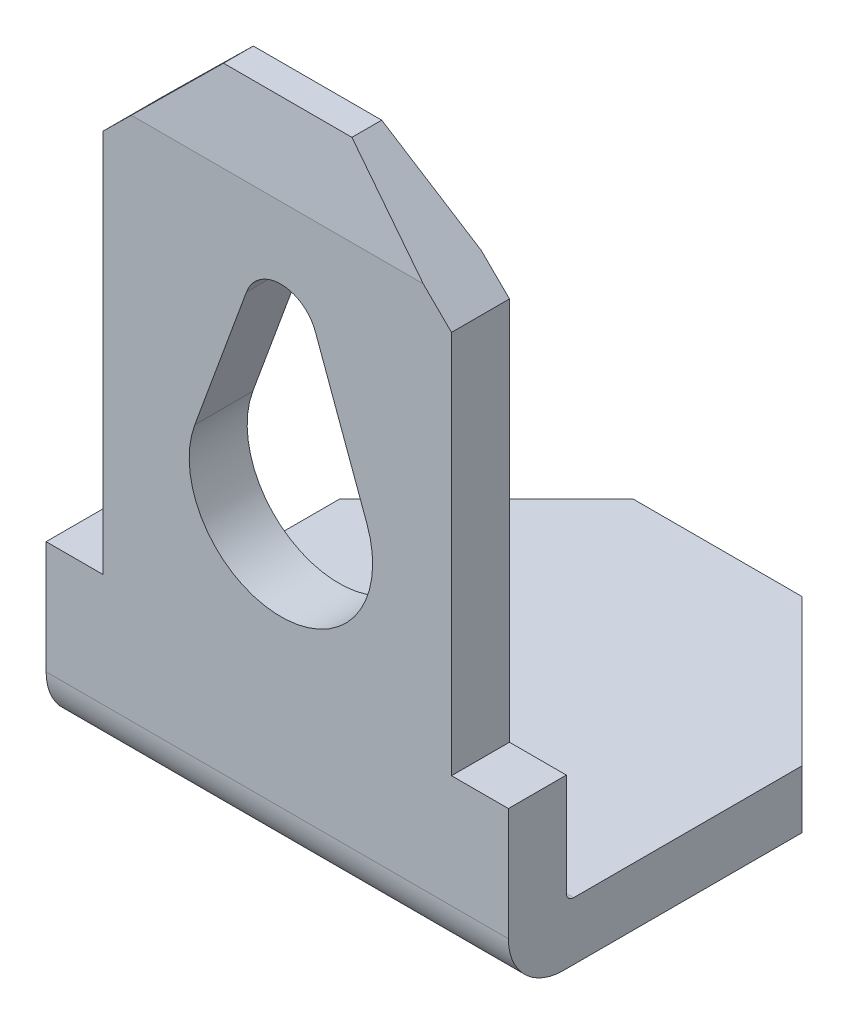
ISO-10303-21;
HEADER;
FILE_DESCRIPTION(('STEP AP214'),'2;1');
FILE_NAME('part.step','',(''),(''),'','','');
FILE_SCHEMA(('AUTOMOTIVE_DESIGN { 1 0 10303 214 1 1 1 1 }'));
ENDSEC;
DATA;
#1=APPLICATION_CONTEXT('core data for automotive mechanical design processes');
#2=APPLICATION_PROTOCOL_DEFINITION('international standard','automotive_design',2000,#1);
#3=PRODUCT_CONTEXT('',#1,'mechanical');
#4=PRODUCT('Part','Part','',(#3));
#5=PRODUCT_RELATED_PRODUCT_CATEGORY('part','',(#4));
#6=PRODUCT_DEFINITION_FORMATION('','',#4);
#7=PRODUCT_DEFINITION_CONTEXT('part definition',#1,'design');
#8=PRODUCT_DEFINITION('design','',#6,#7);
#9=PRODUCT_DEFINITION_SHAPE('','',#8);
#10=(LENGTH_UNIT() NAMED_UNIT(*) SI_UNIT(.MILLI.,.METRE.));
#11=(NAMED_UNIT(*) PLANE_ANGLE_UNIT() SI_UNIT($,.RADIAN.));
#12=(NAMED_UNIT(*) SI_UNIT($,.STERADIAN.) SOLID_ANGLE_UNIT());
#13=UNCERTAINTY_MEASURE_WITH_UNIT(LENGTH_MEASURE(1.E-05),#10,'distance_accuracy_value','');
#14=(GEOMETRIC_REPRESENTATION_CONTEXT(3) GLOBAL_UNCERTAINTY_ASSIGNED_CONTEXT((#13)) GLOBAL_UNIT_ASSIGNED_CONTEXT((#10,
#11,#12)) REPRESENTATION_CONTEXT('',''));
#15=CARTESIAN_POINT('',(0.,0.,0.));
#16=DIRECTION('',(0.,0.,1.));
#17=DIRECTION('',(1.,0.,0.));
#18=AXIS2_PLACEMENT_3D('',#15,#16,#17);
#19=CARTESIAN_POINT('',(6.3,7.11,0.));
#20=DIRECTION('',(0.,-0.214348018272917,0.976757353216485));
#21=DIRECTION('',(0.,-0.976757353216485,-0.214348018272917));
#22=AXIS2_PLACEMENT_3D('',#19,#20,#21);
#23=PLANE('',#22);
#24=DIRECTION('',(-1.,0.,0.));
#25=VECTOR('',#24,1.);
#26=CARTESIAN_POINT('',(6.3,8.21,0.24139344262295));
#27=LINE('',#26,#25);
#28=CARTESIAN_POINT('',(4.025,8.21,0.241393442622949));
#29=VERTEX_POINT('',#28);
#30=CARTESIAN_POINT('',(2.275,8.21,0.241393442622949));
#31=VERTEX_POINT('',#30);
#32=EDGE_CURVE('E204',#29,#31,#27,.T.);
#33=ORIENTED_EDGE('',*,*,#32,.F.);
#34=DIRECTION('',(0.703347952461325,-0.69432379783991,-0.152368374414198));
#35=VECTOR('',#34,1.);
#36=CARTESIAN_POINT('',(5.71349472092454,6.54316914741508,-0.124390228082159));
#37=LINE('',#36,#35);
#38=CARTESIAN_POINT('',(5.13929674470966,7.11,0.));
#39=VERTEX_POINT('',#38);
#40=EDGE_CURVE('E186',#29,#39,#37,.T.);
#41=ORIENTED_EDGE('',*,*,#40,.T.);
#42=DIRECTION('',(-1.,0.,0.));
#43=VECTOR('',#42,1.);
#44=CARTESIAN_POINT('',(6.3,7.11,0.));
#45=LINE('',#44,#43);
#46=CARTESIAN_POINT('',(1.16070325529034,7.11,0.));
#47=VERTEX_POINT('',#46);
#48=EDGE_CURVE('E244',#39,#47,#45,.T.);
#49=ORIENTED_EDGE('',*,*,#48,.T.);
#50=DIRECTION('',(0.703347952461325,0.69432379783991,0.152368374414198));
#51=VECTOR('',#50,1.);
#52=CARTESIAN_POINT('',(3.70310483513415,9.61978184321707,0.550768072151585));
#53=LINE('',#52,#51);
#54=EDGE_CURVE('E252',#47,#31,#53,.T.);
#55=ORIENTED_EDGE('',*,*,#54,.T.);
#56=EDGE_LOOP('',(#33,#41,#49,#55));
#57=FACE_BOUND('',#56,.T.);
#58=ADVANCED_FACE('F32',(#57),#23,.F.);
#59=CARTESIAN_POINT('',(6.3,8.21,0.24139344262295));
#60=DIRECTION('',(0.,-1.,0.));
#61=DIRECTION('',(0.,0.,-1.));
#62=AXIS2_PLACEMENT_3D('',#59,#60,#61);
#63=PLANE('',#62);
#64=DIRECTION('',(-1.,0.,0.));
#65=VECTOR('',#64,1.);
#66=CARTESIAN_POINT('',(6.3,8.21,0.64713114754098));
#67=LINE('',#66,#65);
#68=CARTESIAN_POINT('',(4.025,8.21,0.647131147540979));
#69=VERTEX_POINT('',#68);
#70=CARTESIAN_POINT('',(2.275,8.21,0.647131147540979));
#71=VERTEX_POINT('',#70);
#72=EDGE_CURVE('E201',#69,#71,#67,.T.);
#73=ORIENTED_EDGE('',*,*,#72,.F.);
#74=DIRECTION('',(0.,0.,1.));
#75=VECTOR('',#74,1.);
#76=CARTESIAN_POINT('',(4.025,8.21,-5.21));
#77=LINE('',#76,#75);
#78=EDGE_CURVE('E181',#29,#69,#77,.T.);
#79=ORIENTED_EDGE('',*,*,#78,.F.);
#80=ORIENTED_EDGE('',*,*,#32,.T.);
#81=DIRECTION('',(0.,0.,1.));
#82=VECTOR('',#81,1.);
#83=CARTESIAN_POINT('',(2.275,8.21,-5.21));
#84=LINE('',#83,#82);
#85=EDGE_CURVE('E196',#31,#71,#84,.T.);
#86=ORIENTED_EDGE('',*,*,#85,.T.);
#87=EDGE_LOOP('',(#73,#79,#80,#86));
#88=FACE_BOUND('',#87,.T.);
#89=ADVANCED_FACE('F413',(#88),#63,.F.);
#90=CARTESIAN_POINT('',(6.3,8.21,0.64713114754098));
#91=DIRECTION('',(0.,-0.128798962302804,-0.991670725245896));
#92=DIRECTION('',(0.,0.991670725245896,-0.128798962302804));
#93=AXIS2_PLACEMENT_3D('',#90,#91,#92);
#94=PLANE('',#93);
#95=DIRECTION('',(-1.,0.,0.));
#96=VECTOR('',#95,1.);
#97=CARTESIAN_POINT('',(6.3,7.11,0.79));
#98=LINE('',#97,#96);
#99=CARTESIAN_POINT('',(5.13929674470966,7.11,0.79));
#100=VERTEX_POINT('',#99);
#101=CARTESIAN_POINT('',(1.16070325529034,7.11,0.79));
#102=VERTEX_POINT('',#101);
#103=EDGE_CURVE('E193',#100,#102,#98,.T.);
#104=ORIENTED_EDGE('',*,*,#103,.F.);
#105=DIRECTION('',(-0.708713311399784,0.69962031769454,-0.0908672290418487));
#106=VECTOR('',#105,1.);
#107=CARTESIAN_POINT('',(5.16767461889319,7.0819862220274,0.793638451192715));
#108=LINE('',#107,#106);
#109=EDGE_CURVE('E178',#100,#69,#108,.T.);
#110=ORIENTED_EDGE('',*,*,#109,.T.);
#111=ORIENTED_EDGE('',*,*,#72,.T.);
#112=DIRECTION('',(-0.708713311399784,-0.69962031769454,0.0908672290418487));
#113=VECTOR('',#112,1.);
#114=CARTESIAN_POINT('',(4.29665509496487,10.2057166841054,0.387925918003296));
#115=LINE('',#114,#113);
#116=EDGE_CURVE('E200',#71,#102,#115,.T.);
#117=ORIENTED_EDGE('',*,*,#116,.T.);
#118=EDGE_LOOP('',(#104,#110,#111,#117));
#119=FACE_BOUND('',#118,.T.);
#120=ADVANCED_FACE('F199',(#119),#94,.F.);
#121=CARTESIAN_POINT('',(6.3,7.11,0.79));
#122=DIRECTION('',(0.,0.,-1.));
#123=DIRECTION('',(0.,1.,0.));
#124=AXIS2_PLACEMENT_3D('',#121,#122,#123);
#125=PLANE('',#124);
#126=DIRECTION('',(-0.344583937553277,-0.938755511291561,0.));
#127=VECTOR('',#126,1.);
#128=CARTESIAN_POINT('',(2.73062224435422,5.80882986931079,0.789999999999999));
#129=LINE('',#128,#127);
#130=CARTESIAN_POINT('',(2.73062224435422,5.80882986931079,0.79));
#131=VERTEX_POINT('',#130);
#132=CARTESIAN_POINT('',(2.02655561088555,3.89072992194159,0.789999999999999));
#133=VERTEX_POINT('',#132);
#134=EDGE_CURVE('E293',#131,#133,#129,.T.);
#135=ORIENTED_EDGE('',*,*,#134,.F.);
#136=CARTESIAN_POINT('',(3.2,5.63653790053415,0.789999999999999));
#137=DIRECTION('',(0.,0.,1.));
#138=DIRECTION('',(1.,0.,0.));
#139=AXIS2_PLACEMENT_3D('',#136,#137,#138);
#140=CIRCLE('',#139,0.5);
#141=CARTESIAN_POINT('',(3.66963395220552,5.8081302981974,0.789999999999999));
#142=VERTEX_POINT('',#141);
#143=EDGE_CURVE('E269',#142,#131,#140,.T.);
#144=ORIENTED_EDGE('',*,*,#143,.F.);
#145=DIRECTION('',(-0.344584192655147,0.938755417652649,0.));
#146=VECTOR('',#145,1.);
#147=CARTESIAN_POINT('',(3.66963395220552,5.8081302981974,0.789999999999999));
#148=LINE('',#147,#146);
#149=CARTESIAN_POINT('',(4.37344427206581,3.89073024081893,0.789999999999999));
#150=VERTEX_POINT('',#149);
#151=EDGE_CURVE('E299',#150,#142,#148,.T.);
#152=ORIENTED_EDGE('',*,*,#151,.F.);
#153=CARTESIAN_POINT('',(3.2,3.46,0.789999999999999));
#154=DIRECTION('',(0.,0.,1.));
#155=DIRECTION('',(1.,0.,0.));
#156=AXIS2_PLACEMENT_3D('',#153,#154,#155);
#157=CIRCLE('',#156,1.25);
#158=EDGE_CURVE('E296',#133,#150,#157,.T.);
#159=ORIENTED_EDGE('',*,*,#158,.F.);
#160=EDGE_LOOP('',(#135,#144,#152,#159));
#161=FACE_BOUND('',#160,.T.);
#162=DIRECTION('',(0.,-1.,0.));
#163=VECTOR('',#162,1.);
#164=CARTESIAN_POINT('',(5.525,1.49672365683442,0.789999999999999));
#165=LINE('',#164,#163);
#166=CARTESIAN_POINT('',(5.525,6.729245427366,0.79));
#167=VERTEX_POINT('',#166);
#168=CARTESIAN_POINT('',(5.525,1.49672365683442,0.789999999999999));
#169=VERTEX_POINT('',#168);
#170=EDGE_CURVE('E195',#167,#169,#165,.T.);
#171=ORIENTED_EDGE('',*,*,#170,.F.);
#172=DIRECTION('',(0.711657426770076,-0.702526659225822,0.));
#173=VECTOR('',#172,1.);
#174=CARTESIAN_POINT('',(5.54449556096771,6.71,0.79));
#175=LINE('',#174,#173);
#176=EDGE_CURVE('E54',#100,#167,#175,.T.);
#177=ORIENTED_EDGE('',*,*,#176,.F.);
#178=ORIENTED_EDGE('',*,*,#103,.T.);
#179=DIRECTION('',(0.711657426770076,0.702526659225822,0.));
#180=VECTOR('',#179,1.);
#181=CARTESIAN_POINT('',(0.755504439032288,6.71,0.79));
#182=LINE('',#181,#180);
#183=CARTESIAN_POINT('',(0.775,6.729245427366,0.79));
#184=VERTEX_POINT('',#183);
#185=EDGE_CURVE('E561',#184,#102,#182,.T.);
#186=ORIENTED_EDGE('',*,*,#185,.F.);
#187=DIRECTION('',(0.,1.,0.));
#188=VECTOR('',#187,1.);
#189=CARTESIAN_POINT('',(0.775,1.49672365683442,0.789999999999999));
#190=LINE('',#189,#188);
#191=CARTESIAN_POINT('',(0.775,1.49672365683442,0.789999999999999));
#192=VERTEX_POINT('',#191);
#193=EDGE_CURVE('E270',#192,#184,#190,.T.);
#194=ORIENTED_EDGE('',*,*,#193,.F.);
#195=DIRECTION('',(1.,0.,0.));
#196=VECTOR('',#195,1.);
#197=CARTESIAN_POINT('',(0.,1.49672365683442,0.789999999999999));
#198=LINE('',#197,#196);
#199=CARTESIAN_POINT('',(0.,1.49672365683442,0.789999999999999));
#200=VERTEX_POINT('',#199);
#201=EDGE_CURVE('E263',#200,#192,#198,.T.);
#202=ORIENTED_EDGE('',*,*,#201,.F.);
#203=DIRECTION('',(0.,-1.,0.));
#204=VECTOR('',#203,1.);
#205=CARTESIAN_POINT('',(0.,7.11,0.79));
#206=LINE('',#205,#204);
#207=CARTESIAN_POINT('',(0.,-0.0400000000000005,0.789999999999999));
#208=VERTEX_POINT('',#207);
#209=EDGE_CURVE('E311',#200,#208,#206,.T.);
#210=ORIENTED_EDGE('',*,*,#209,.T.);
#211=DIRECTION('',(-1.,0.,0.));
#212=VECTOR('',#211,1.);
#213=CARTESIAN_POINT('',(6.3,-0.0400000000000005,0.789999999999999));
#214=LINE('',#213,#212);
#215=CARTESIAN_POINT('',(6.3,-0.0400000000000005,0.789999999999999));
#216=VERTEX_POINT('',#215);
#217=EDGE_CURVE('E202',#216,#208,#214,.T.);
#218=ORIENTED_EDGE('',*,*,#217,.F.);
#219=DIRECTION('',(0.,-1.,0.));
#220=VECTOR('',#219,1.);
#221=CARTESIAN_POINT('',(6.3,7.11,0.79));
#222=LINE('',#221,#220);
#223=CARTESIAN_POINT('',(6.3,1.49672365683442,0.789999999999999));
#224=VERTEX_POINT('',#223);
#225=EDGE_CURVE('E312',#224,#216,#222,.T.);
#226=ORIENTED_EDGE('',*,*,#225,.F.);
#227=DIRECTION('',(1.,0.,0.));
#228=VECTOR('',#227,1.);
#229=CARTESIAN_POINT('',(6.3,1.49672365683442,0.789999999999999));
#230=LINE('',#229,#228);
#231=EDGE_CURVE('E258',#169,#224,#230,.T.);
#232=ORIENTED_EDGE('',*,*,#231,.F.);
#233=EDGE_LOOP('',(#171,#177,#178,#186,#194,#202,#210,#218,#226,#232));
#234=FACE_BOUND('',#233,.T.);
#235=ADVANCED_FACE('F191',(#161,#234),#125,.F.);
#236=CARTESIAN_POINT('',(6.3,-0.0400000000000006,0.0399999999999991));
#237=DIRECTION('',(-1.,0.,0.));
#238=DIRECTION('',(0.,0.,1.));
#239=AXIS2_PLACEMENT_3D('',#236,#237,#238);
#240=CYLINDRICAL_SURFACE('',#239,0.75);
#241=CARTESIAN_POINT('',(0.,-0.0400000000000006,0.0399999999999991));
#242=DIRECTION('',(1.,0.,0.));
#243=DIRECTION('',(0.,0.,-1.));
#244=AXIS2_PLACEMENT_3D('',#241,#242,#243);
#245=CIRCLE('',#244,0.75);
#246=CARTESIAN_POINT('',(0.,-0.790000000000001,0.0399999999999991));
#247=VERTEX_POINT('',#246);
#248=EDGE_CURVE('E328',#208,#247,#245,.T.);
#249=ORIENTED_EDGE('',*,*,#248,.T.);
#250=DIRECTION('',(-1.,0.,0.));
#251=VECTOR('',#250,1.);
#252=CARTESIAN_POINT('',(6.3,-0.790000000000001,0.0399999999999991));
#253=LINE('',#252,#251);
#254=CARTESIAN_POINT('',(6.3,-0.790000000000001,0.0399999999999991));
#255=VERTEX_POINT('',#254);
#256=EDGE_CURVE('E207',#255,#247,#253,.T.);
#257=ORIENTED_EDGE('',*,*,#256,.F.);
#258=CARTESIAN_POINT('',(6.3,-0.0400000000000006,0.0399999999999991));
#259=DIRECTION('',(1.,0.,0.));
#260=DIRECTION('',(0.,0.,-1.));
#261=AXIS2_PLACEMENT_3D('',#258,#259,#260);
#262=CIRCLE('',#261,0.75);
#263=EDGE_CURVE('E314',#216,#255,#262,.T.);
#264=ORIENTED_EDGE('',*,*,#263,.F.);
#265=ORIENTED_EDGE('',*,*,#217,.T.);
#266=EDGE_LOOP('',(#249,#257,#264,#265));
#267=FACE_BOUND('',#266,.T.);
#268=ADVANCED_FACE('F384',(#267),#240,.T.);
#269=CARTESIAN_POINT('',(6.3,-0.790000000000001,0.0399999999999991));
#270=DIRECTION('',(0.,1.,0.));
#271=DIRECTION('',(0.,0.,1.));
#272=AXIS2_PLACEMENT_3D('',#269,#270,#271);
#273=PLANE('',#272);
#274=DIRECTION('',(-1.,0.,0.));
#275=VECTOR('',#274,1.);
#276=CARTESIAN_POINT('',(6.3,-0.790000000000001,-5.21));
#277=LINE('',#276,#275);
#278=CARTESIAN_POINT('',(4.29999999999999,-0.790000000000001,-5.21));
#279=VERTEX_POINT('',#278);
#280=CARTESIAN_POINT('',(2.,-0.790000000000001,-5.21));
#281=VERTEX_POINT('',#280);
#282=EDGE_CURVE('E349',#279,#281,#277,.T.);
#283=ORIENTED_EDGE('',*,*,#282,.F.);
#284=DIRECTION('',(0.707106781186549,0.,0.707106781186546));
#285=VECTOR('',#284,1.);
#286=CARTESIAN_POINT('',(6.3,-0.790000000000001,-3.21));
#287=LINE('',#286,#285);
#288=CARTESIAN_POINT('',(6.3,-0.790000000000001,-3.21));
#289=VERTEX_POINT('',#288);
#290=EDGE_CURVE('E227',#279,#289,#287,.T.);
#291=ORIENTED_EDGE('',*,*,#290,.T.);
#292=DIRECTION('',(0.,0.,-1.));
#293=VECTOR('',#292,1.);
#294=CARTESIAN_POINT('',(6.3,-0.790000000000001,0.0399999999999991));
#295=LINE('',#294,#293);
#296=EDGE_CURVE('E317',#255,#289,#295,.T.);
#297=ORIENTED_EDGE('',*,*,#296,.F.);
#298=ORIENTED_EDGE('',*,*,#256,.T.);
#299=DIRECTION('',(0.,0.,-1.));
#300=VECTOR('',#299,1.);
#301=CARTESIAN_POINT('',(0.,-0.790000000000001,0.0399999999999991));
#302=LINE('',#301,#300);
#303=CARTESIAN_POINT('',(0.,-0.790000000000001,-3.21));
#304=VERTEX_POINT('',#303);
#305=EDGE_CURVE('E330',#247,#304,#302,.T.);
#306=ORIENTED_EDGE('',*,*,#305,.T.);
#307=DIRECTION('',(-0.707106781186546,0.,0.707106781186549));
#308=VECTOR('',#307,1.);
#309=CARTESIAN_POINT('',(2.,-0.790000000000001,-5.21));
#310=LINE('',#309,#308);
#311=EDGE_CURVE('E225',#304,#281,#310,.F.);
#312=ORIENTED_EDGE('',*,*,#311,.T.);
#313=EDGE_LOOP('',(#283,#291,#297,#298,#306,#312));
#314=FACE_BOUND('',#313,.T.);
#315=ADVANCED_FACE('F357',(#314),#273,.F.);
#316=CARTESIAN_POINT('',(6.3,-0.790000000000001,-5.21));
#317=DIRECTION('',(0.,0.,1.));
#318=DIRECTION('',(1.,0.,0.));
#319=AXIS2_PLACEMENT_3D('',#316,#317,#318);
#320=PLANE('',#319);
#321=DIRECTION('',(-1.,0.,0.));
#322=VECTOR('',#321,1.);
#323=CARTESIAN_POINT('',(6.3,0.,-5.21));
#324=LINE('',#323,#322);
#325=CARTESIAN_POINT('',(4.29999999999999,0.,-5.21));
#326=VERTEX_POINT('',#325);
#327=CARTESIAN_POINT('',(2.,0.,-5.21));
#328=VERTEX_POINT('',#327);
#329=EDGE_CURVE('E346',#326,#328,#324,.T.);
#330=ORIENTED_EDGE('',*,*,#329,.F.);
#331=DIRECTION('',(0.,-1.,0.));
#332=VECTOR('',#331,1.);
#333=CARTESIAN_POINT('',(4.29999999999999,-0.790000000000001,-5.21));
#334=LINE('',#333,#332);
#335=EDGE_CURVE('E223',#326,#279,#334,.T.);
#336=ORIENTED_EDGE('',*,*,#335,.T.);
#337=ORIENTED_EDGE('',*,*,#282,.T.);
#338=DIRECTION('',(0.,1.,0.));
#339=VECTOR('',#338,1.);
#340=CARTESIAN_POINT('',(2.,-0.790000000000001,-5.21));
#341=LINE('',#340,#339);
#342=EDGE_CURVE('E220',#281,#328,#341,.T.);
#343=ORIENTED_EDGE('',*,*,#342,.T.);
#344=EDGE_LOOP('',(#330,#336,#337,#343));
#345=FACE_BOUND('',#344,.T.);
#346=ADVANCED_FACE('F373',(#345),#320,.F.);
#347=CARTESIAN_POINT('',(6.3,0.,-5.21));
#348=DIRECTION('',(0.,-1.,0.));
#349=DIRECTION('',(0.,0.,-1.));
#350=AXIS2_PLACEMENT_3D('',#347,#348,#349);
#351=PLANE('',#350);
#352=DIRECTION('',(0.,0.,1.));
#353=VECTOR('',#352,1.);
#354=CARTESIAN_POINT('',(6.3,0.,-5.21));
#355=LINE('',#354,#353);
#356=CARTESIAN_POINT('',(6.3,0.,-3.21));
#357=VERTEX_POINT('',#356);
#358=CARTESIAN_POINT('',(6.3,0.,-0.100000000000001));
#359=VERTEX_POINT('',#358);
#360=EDGE_CURVE('E320',#357,#359,#355,.T.);
#361=ORIENTED_EDGE('',*,*,#360,.F.);
#362=DIRECTION('',(-0.707106781186549,0.,-0.707106781186546));
#363=VECTOR('',#362,1.);
#364=CARTESIAN_POINT('',(6.3,0.,-3.21));
#365=LINE('',#364,#363);
#366=EDGE_CURVE('E218',#357,#326,#365,.T.);
#367=ORIENTED_EDGE('',*,*,#366,.T.);
#368=ORIENTED_EDGE('',*,*,#329,.T.);
#369=DIRECTION('',(0.707106781186546,0.,-0.707106781186549));
#370=VECTOR('',#369,1.);
#371=CARTESIAN_POINT('',(2.,0.,-5.21));
#372=LINE('',#371,#370);
#373=CARTESIAN_POINT('',(0.,0.,-3.21));
#374=VERTEX_POINT('',#373);
#375=EDGE_CURVE('E216',#328,#374,#372,.F.);
#376=ORIENTED_EDGE('',*,*,#375,.T.);
#377=DIRECTION('',(0.,0.,1.));
#378=VECTOR('',#377,1.);
#379=CARTESIAN_POINT('',(0.,0.,-5.21));
#380=LINE('',#379,#378);
#381=CARTESIAN_POINT('',(0.,0.,-0.100000000000001));
#382=VERTEX_POINT('',#381);
#383=EDGE_CURVE('E333',#374,#382,#380,.T.);
#384=ORIENTED_EDGE('',*,*,#383,.T.);
#385=DIRECTION('',(-1.,0.,0.));
#386=VECTOR('',#385,1.);
#387=CARTESIAN_POINT('',(6.3,0.,-0.100000000000001));
#388=LINE('',#387,#386);
#389=EDGE_CURVE('E343',#359,#382,#388,.T.);
#390=ORIENTED_EDGE('',*,*,#389,.F.);
#391=EDGE_LOOP('',(#361,#367,#368,#376,#384,#390));
#392=FACE_BOUND('',#391,.T.);
#393=ADVANCED_FACE('F398',(#392),#351,.F.);
#394=CARTESIAN_POINT('',(6.3,0.1,-0.1));
#395=DIRECTION('',(-1.,0.,0.));
#396=DIRECTION('',(0.,0.,1.));
#397=AXIS2_PLACEMENT_3D('',#394,#395,#396);
#398=CYLINDRICAL_SURFACE('',#397,0.1);
#399=CARTESIAN_POINT('',(0.,0.1,-0.1));
#400=DIRECTION('',(-1.,0.,0.));
#401=DIRECTION('',(0.,0.,-1.));
#402=AXIS2_PLACEMENT_3D('',#399,#400,#401);
#403=CIRCLE('',#402,0.1);
#404=CARTESIAN_POINT('',(0.,0.100000000000001,0.));
#405=VERTEX_POINT('',#404);
#406=EDGE_CURVE('E335',#382,#405,#403,.T.);
#407=ORIENTED_EDGE('',*,*,#406,.T.);
#408=DIRECTION('',(-1.,0.,0.));
#409=VECTOR('',#408,1.);
#410=CARTESIAN_POINT('',(6.3,0.100000000000001,0.));
#411=LINE('',#410,#409);
#412=CARTESIAN_POINT('',(6.3,0.100000000000001,0.));
#413=VERTEX_POINT('',#412);
#414=EDGE_CURVE('E340',#413,#405,#411,.T.);
#415=ORIENTED_EDGE('',*,*,#414,.F.);
#416=CARTESIAN_POINT('',(6.3,0.1,-0.1));
#417=DIRECTION('',(-1.,0.,0.));
#418=DIRECTION('',(0.,0.,-1.));
#419=AXIS2_PLACEMENT_3D('',#416,#417,#418);
#420=CIRCLE('',#419,0.1);
#421=EDGE_CURVE('E322',#359,#413,#420,.T.);
#422=ORIENTED_EDGE('',*,*,#421,.F.);
#423=ORIENTED_EDGE('',*,*,#389,.T.);
#424=EDGE_LOOP('',(#407,#415,#422,#423));
#425=FACE_BOUND('',#424,.T.);
#426=ADVANCED_FACE('F395',(#425),#398,.F.);
#427=CARTESIAN_POINT('',(6.3,0.100000000000001,0.));
#428=DIRECTION('',(0.,0.,1.));
#429=DIRECTION('',(0.,-1.,0.));
#430=AXIS2_PLACEMENT_3D('',#427,#428,#429);
#431=PLANE('',#430);
#432=DIRECTION('',(0.344584192655147,-0.938755417652649,0.));
#433=VECTOR('',#432,1.);
#434=CARTESIAN_POINT('',(3.66963395220552,5.8081302981974,0.));
#435=LINE('',#434,#433);
#436=CARTESIAN_POINT('',(3.66963395220552,5.8081302981974,0.));
#437=VERTEX_POINT('',#436);
#438=CARTESIAN_POINT('',(4.37344427206581,3.89073024081893,0.));
#439=VERTEX_POINT('',#438);
#440=EDGE_CURVE('E286',#437,#439,#435,.T.);
#441=ORIENTED_EDGE('',*,*,#440,.F.);
#442=CARTESIAN_POINT('',(3.2,5.63653790053415,0.));
#443=DIRECTION('',(0.,0.,1.));
#444=DIRECTION('',(0.,-1.,0.));
#445=AXIS2_PLACEMENT_3D('',#442,#443,#444);
#446=CIRCLE('',#445,0.5);
#447=CARTESIAN_POINT('',(2.73062224435422,5.80882986931079,0.));
#448=VERTEX_POINT('',#447);
#449=EDGE_CURVE('E289',#448,#437,#446,.F.);
#450=ORIENTED_EDGE('',*,*,#449,.F.);
#451=DIRECTION('',(0.344583937553277,0.938755511291561,0.));
#452=VECTOR('',#451,1.);
#453=CARTESIAN_POINT('',(2.73062224435422,5.80882986931079,0.));
#454=LINE('',#453,#452);
#455=CARTESIAN_POINT('',(2.02655561088555,3.89072992194159,0.));
#456=VERTEX_POINT('',#455);
#457=EDGE_CURVE('E291',#456,#448,#454,.T.);
#458=ORIENTED_EDGE('',*,*,#457,.F.);
#459=CARTESIAN_POINT('',(3.2,3.46,0.));
#460=DIRECTION('',(0.,0.,1.));
#461=DIRECTION('',(0.,-1.,0.));
#462=AXIS2_PLACEMENT_3D('',#459,#460,#461);
#463=CIRCLE('',#462,1.25);
#464=EDGE_CURVE('E283',#439,#456,#463,.F.);
#465=ORIENTED_EDGE('',*,*,#464,.F.);
#466=EDGE_LOOP('',(#441,#450,#458,#465));
#467=FACE_BOUND('',#466,.T.);
#468=ORIENTED_EDGE('',*,*,#48,.F.);
#469=DIRECTION('',(0.711657426770076,-0.702526659225822,0.));
#470=VECTOR('',#469,1.);
#471=CARTESIAN_POINT('',(9.23184999768602,3.06995537127141,0.));
#472=LINE('',#471,#470);
#473=CARTESIAN_POINT('',(5.525,6.729245427366,0.));
#474=VERTEX_POINT('',#473);
#475=EDGE_CURVE('E237',#39,#474,#472,.T.);
#476=ORIENTED_EDGE('',*,*,#475,.T.);
#477=DIRECTION('',(0.,1.,0.));
#478=VECTOR('',#477,1.);
#479=CARTESIAN_POINT('',(5.525,1.49672365683442,0.));
#480=LINE('',#479,#478);
#481=CARTESIAN_POINT('',(5.525,1.49672365683442,0.));
#482=VERTEX_POINT('',#481);
#483=EDGE_CURVE('E235',#482,#474,#480,.T.);
#484=ORIENTED_EDGE('',*,*,#483,.F.);
#485=DIRECTION('',(-1.,0.,0.));
#486=VECTOR('',#485,1.);
#487=CARTESIAN_POINT('',(6.3,1.49672365683442,0.));
#488=LINE('',#487,#486);
#489=CARTESIAN_POINT('',(6.3,1.49672365683442,0.));
#490=VERTEX_POINT('',#489);
#491=EDGE_CURVE('E260',#490,#482,#488,.T.);
#492=ORIENTED_EDGE('',*,*,#491,.F.);
#493=DIRECTION('',(0.,1.,0.));
#494=VECTOR('',#493,1.);
#495=CARTESIAN_POINT('',(6.3,0.100000000000001,0.));
#496=LINE('',#495,#494);
#497=EDGE_CURVE('E324',#413,#490,#496,.T.);
#498=ORIENTED_EDGE('',*,*,#497,.F.);
#499=ORIENTED_EDGE('',*,*,#414,.T.);
#500=DIRECTION('',(0.,1.,0.));
#501=VECTOR('',#500,1.);
#502=CARTESIAN_POINT('',(0.,0.100000000000001,0.));
#503=LINE('',#502,#501);
#504=CARTESIAN_POINT('',(0.,1.49672365683442,0.));
#505=VERTEX_POINT('',#504);
#506=EDGE_CURVE('E315',#405,#505,#503,.T.);
#507=ORIENTED_EDGE('',*,*,#506,.T.);
#508=DIRECTION('',(-1.,0.,0.));
#509=VECTOR('',#508,1.);
#510=CARTESIAN_POINT('',(0.,1.49672365683442,0.));
#511=LINE('',#510,#509);
#512=CARTESIAN_POINT('',(0.775,1.49672365683442,0.));
#513=VERTEX_POINT('',#512);
#514=EDGE_CURVE('E276',#513,#505,#511,.T.);
#515=ORIENTED_EDGE('',*,*,#514,.F.);
#516=DIRECTION('',(0.,-1.,0.));
#517=VECTOR('',#516,1.);
#518=CARTESIAN_POINT('',(0.775,1.49672365683442,0.));
#519=LINE('',#518,#517);
#520=CARTESIAN_POINT('',(0.775,6.729245427366,0.));
#521=VERTEX_POINT('',#520);
#522=EDGE_CURVE('E256',#521,#513,#519,.T.);
#523=ORIENTED_EDGE('',*,*,#522,.F.);
#524=DIRECTION('',(0.711657426770076,0.702526659225822,0.));
#525=VECTOR('',#524,1.);
#526=CARTESIAN_POINT('',(0.258824648699115,6.21969275288617,0.));
#527=LINE('',#526,#525);
#528=EDGE_CURVE('E47',#521,#47,#527,.T.);
#529=ORIENTED_EDGE('',*,*,#528,.T.);
#530=EDGE_LOOP('',(#468,#476,#484,#492,#498,#499,#507,#515,#523,#529));
#531=FACE_BOUND('',#530,.T.);
#532=ADVANCED_FACE('F241',(#467,#531),#431,.F.);
#533=CARTESIAN_POINT('',(6.3,-0.0400000000000006,0.0399999999999991));
#534=DIRECTION('',(1.,0.,0.));
#535=DIRECTION('',(0.,0.,-1.));
#536=AXIS2_PLACEMENT_3D('',#533,#534,#535);
#537=PLANE('',#536);
#538=DIRECTION('',(0.,0.,-1.));
#539=VECTOR('',#538,1.);
#540=CARTESIAN_POINT('',(6.3,1.49672365683442,7.54786240313508));
#541=LINE('',#540,#539);
#542=EDGE_CURVE('E265',#224,#490,#541,.T.);
#543=ORIENTED_EDGE('',*,*,#542,.F.);
#544=ORIENTED_EDGE('',*,*,#225,.T.);
#545=ORIENTED_EDGE('',*,*,#263,.T.);
#546=ORIENTED_EDGE('',*,*,#296,.T.);
#547=DIRECTION('',(0.,1.,0.));
#548=VECTOR('',#547,1.);
#549=CARTESIAN_POINT('',(6.3,0.,-3.21));
#550=LINE('',#549,#548);
#551=EDGE_CURVE('E213',#289,#357,#550,.T.);
#552=ORIENTED_EDGE('',*,*,#551,.T.);
#553=ORIENTED_EDGE('',*,*,#360,.T.);
#554=ORIENTED_EDGE('',*,*,#421,.T.);
#555=ORIENTED_EDGE('',*,*,#497,.T.);
#556=EDGE_LOOP('',(#543,#544,#545,#546,#552,#553,#554,#555));
#557=FACE_BOUND('',#556,.T.);
#558=ADVANCED_FACE('F380',(#557),#537,.T.);
#559=CARTESIAN_POINT('',(0.,-0.0400000000000006,0.0399999999999991));
#560=DIRECTION('',(1.,0.,0.));
#561=DIRECTION('',(0.,0.,-1.));
#562=AXIS2_PLACEMENT_3D('',#559,#560,#561);
#563=PLANE('',#562);
#564=ORIENTED_EDGE('',*,*,#209,.F.);
#565=DIRECTION('',(0.,0.,-1.));
#566=VECTOR('',#565,1.);
#567=CARTESIAN_POINT('',(0.,1.49672365683442,7.54786240313508));
#568=LINE('',#567,#566);
#569=EDGE_CURVE('E273',#200,#505,#568,.T.);
#570=ORIENTED_EDGE('',*,*,#569,.T.);
#571=ORIENTED_EDGE('',*,*,#506,.F.);
#572=ORIENTED_EDGE('',*,*,#406,.F.);
#573=ORIENTED_EDGE('',*,*,#383,.F.);
#574=DIRECTION('',(0.,-1.,0.));
#575=VECTOR('',#574,1.);
#576=CARTESIAN_POINT('',(0.,-0.0400000000000006,-3.21));
#577=LINE('',#576,#575);
#578=EDGE_CURVE('E229',#374,#304,#577,.T.);
#579=ORIENTED_EDGE('',*,*,#578,.T.);
#580=ORIENTED_EDGE('',*,*,#305,.F.);
#581=ORIENTED_EDGE('',*,*,#248,.F.);
#582=EDGE_LOOP('',(#564,#570,#571,#572,#573,#579,#580,#581));
#583=FACE_BOUND('',#582,.T.);
#584=ADVANCED_FACE('F364',(#583),#563,.F.);
#585=CARTESIAN_POINT('',(6.3,-0.0400000000000006,-3.21));
#586=DIRECTION('',(0.707106781186546,0.,-0.707106781186549));
#587=DIRECTION('',(0.,-1.,0.));
#588=AXIS2_PLACEMENT_3D('',#585,#586,#587);
#589=PLANE('',#588);
#590=ORIENTED_EDGE('',*,*,#290,.F.);
#591=ORIENTED_EDGE('',*,*,#335,.F.);
#592=ORIENTED_EDGE('',*,*,#366,.F.);
#593=ORIENTED_EDGE('',*,*,#551,.F.);
#594=EDGE_LOOP('',(#590,#591,#592,#593));
#595=FACE_BOUND('',#594,.T.);
#596=ADVANCED_FACE('F376',(#595),#589,.T.);
#597=CARTESIAN_POINT('',(2.,-0.790000000000001,-5.21));
#598=DIRECTION('',(0.707106781186549,0.,0.707106781186546));
#599=DIRECTION('',(0.,1.,0.));
#600=AXIS2_PLACEMENT_3D('',#597,#598,#599);
#601=PLANE('',#600);
#602=ORIENTED_EDGE('',*,*,#311,.F.);
#603=ORIENTED_EDGE('',*,*,#578,.F.);
#604=ORIENTED_EDGE('',*,*,#375,.F.);
#605=ORIENTED_EDGE('',*,*,#342,.F.);
#606=EDGE_LOOP('',(#602,#603,#604,#605));
#607=FACE_BOUND('',#606,.T.);
#608=ADVANCED_FACE('F34',(#607),#601,.F.);
#609=CARTESIAN_POINT('',(3.2,5.63653790053415,-4.65485766531385));
#610=DIRECTION('',(0.,0.,1.));
#611=DIRECTION('',(1.,0.,0.));
#612=AXIS2_PLACEMENT_3D('',#609,#610,#611);
#613=CYLINDRICAL_SURFACE('',#612,0.5);
#614=ORIENTED_EDGE('',*,*,#449,.T.);
#615=DIRECTION('',(0.,0.,1.));
#616=VECTOR('',#615,1.);
#617=CARTESIAN_POINT('',(3.66963395220552,5.8081302981974,-4.65485766531385));
#618=LINE('',#617,#616);
#619=EDGE_CURVE('E287',#437,#142,#618,.T.);
#620=ORIENTED_EDGE('',*,*,#619,.T.);
#621=ORIENTED_EDGE('',*,*,#143,.T.);
#622=DIRECTION('',(0.,0.,1.));
#623=VECTOR('',#622,1.);
#624=CARTESIAN_POINT('',(2.73062224435422,5.80882986931079,-4.65485766531385));
#625=LINE('',#624,#623);
#626=EDGE_CURVE('E302',#448,#131,#625,.T.);
#627=ORIENTED_EDGE('',*,*,#626,.F.);
#628=EDGE_LOOP('',(#614,#620,#621,#627));
#629=FACE_BOUND('',#628,.T.);
#630=ADVANCED_FACE('F428',(#629),#613,.F.);
#631=CARTESIAN_POINT('',(3.66963395220552,5.8081302981974,-4.65485766531385));
#632=DIRECTION('',(0.93875541765265,0.344584192655147,0.));
#633=DIRECTION('',(-0.344584192655147,0.938755417652649,0.));
#634=AXIS2_PLACEMENT_3D('',#631,#632,#633);
#635=PLANE('',#634);
#636=ORIENTED_EDGE('',*,*,#440,.T.);
#637=DIRECTION('',(0.,0.,1.));
#638=VECTOR('',#637,1.);
#639=CARTESIAN_POINT('',(4.37344427206581,3.89073024081893,-4.65485766531385));
#640=LINE('',#639,#638);
#641=EDGE_CURVE('E304',#439,#150,#640,.T.);
#642=ORIENTED_EDGE('',*,*,#641,.T.);
#643=ORIENTED_EDGE('',*,*,#151,.T.);
#644=ORIENTED_EDGE('',*,*,#619,.F.);
#645=EDGE_LOOP('',(#636,#642,#643,#644));
#646=FACE_BOUND('',#645,.T.);
#647=ADVANCED_FACE('F570',(#646),#635,.F.);
#648=CARTESIAN_POINT('',(3.2,3.46,-4.65485766531385));
#649=DIRECTION('',(0.,0.,1.));
#650=DIRECTION('',(1.,0.,0.));
#651=AXIS2_PLACEMENT_3D('',#648,#649,#650);
#652=CYLINDRICAL_SURFACE('',#651,1.25);
#653=ORIENTED_EDGE('',*,*,#464,.T.);
#654=DIRECTION('',(0.,0.,1.));
#655=VECTOR('',#654,1.);
#656=CARTESIAN_POINT('',(2.02655561088555,3.89072992194159,-4.65485766531385));
#657=LINE('',#656,#655);
#658=EDGE_CURVE('E306',#456,#133,#657,.T.);
#659=ORIENTED_EDGE('',*,*,#658,.T.);
#660=ORIENTED_EDGE('',*,*,#158,.T.);
#661=ORIENTED_EDGE('',*,*,#641,.F.);
#662=EDGE_LOOP('',(#653,#659,#660,#661));
#663=FACE_BOUND('',#662,.T.);
#664=ADVANCED_FACE('F566',(#663),#652,.F.);
#665=CARTESIAN_POINT('',(2.73062224435422,5.80882986931079,-4.65485766531385));
#666=DIRECTION('',(-0.938755511291561,0.344583937553277,0.));
#667=DIRECTION('',(-0.344583937553277,-0.938755511291561,0.));
#668=AXIS2_PLACEMENT_3D('',#665,#666,#667);
#669=PLANE('',#668);
#670=ORIENTED_EDGE('',*,*,#457,.T.);
#671=ORIENTED_EDGE('',*,*,#626,.T.);
#672=ORIENTED_EDGE('',*,*,#134,.T.);
#673=ORIENTED_EDGE('',*,*,#658,.F.);
#674=EDGE_LOOP('',(#670,#671,#672,#673));
#675=FACE_BOUND('',#674,.T.);
#676=ADVANCED_FACE('F495',(#675),#669,.F.);
#677=CARTESIAN_POINT('',(0.775,1.49672365683442,7.54786240313508));
#678=DIRECTION('',(1.,0.,0.));
#679=DIRECTION('',(0.,0.,-1.));
#680=AXIS2_PLACEMENT_3D('',#677,#678,#679);
#681=PLANE('',#680);
#682=ORIENTED_EDGE('',*,*,#193,.T.);
#683=DIRECTION('',(0.,0.,-1.));
#684=VECTOR('',#683,1.);
#685=CARTESIAN_POINT('',(0.775,6.729245427366,7.54786240313508));
#686=LINE('',#685,#684);
#687=EDGE_CURVE('E11',#184,#521,#686,.T.);
#688=ORIENTED_EDGE('',*,*,#687,.T.);
#689=ORIENTED_EDGE('',*,*,#522,.T.);
#690=DIRECTION('',(0.,0.,-1.));
#691=VECTOR('',#690,1.);
#692=CARTESIAN_POINT('',(0.775,1.49672365683442,7.54786240313508));
#693=LINE('',#692,#691);
#694=EDGE_CURVE('E278',#192,#513,#693,.T.);
#695=ORIENTED_EDGE('',*,*,#694,.F.);
#696=EDGE_LOOP('',(#682,#688,#689,#695));
#697=FACE_BOUND('',#696,.T.);
#698=ADVANCED_FACE('F508',(#697),#681,.F.);
#699=CARTESIAN_POINT('',(0.,1.49672365683442,7.54786240313508));
#700=DIRECTION('',(0.,-1.,0.));
#701=DIRECTION('',(0.,0.,-1.));
#702=AXIS2_PLACEMENT_3D('',#699,#700,#701);
#703=PLANE('',#702);
#704=ORIENTED_EDGE('',*,*,#201,.T.);
#705=ORIENTED_EDGE('',*,*,#694,.T.);
#706=ORIENTED_EDGE('',*,*,#514,.T.);
#707=ORIENTED_EDGE('',*,*,#569,.F.);
#708=EDGE_LOOP('',(#704,#705,#706,#707));
#709=FACE_BOUND('',#708,.T.);
#710=ADVANCED_FACE('F409',(#709),#703,.F.);
#711=CARTESIAN_POINT('',(5.525,1.49672365683442,7.54786240313508));
#712=DIRECTION('',(-1.,0.,0.));
#713=DIRECTION('',(0.,0.,1.));
#714=AXIS2_PLACEMENT_3D('',#711,#712,#713);
#715=PLANE('',#714);
#716=ORIENTED_EDGE('',*,*,#483,.T.);
#717=DIRECTION('',(0.,0.,1.));
#718=VECTOR('',#717,1.);
#719=CARTESIAN_POINT('',(5.525,6.729245427366,7.54786240313508));
#720=LINE('',#719,#718);
#721=EDGE_CURVE('E40',#474,#167,#720,.T.);
#722=ORIENTED_EDGE('',*,*,#721,.T.);
#723=ORIENTED_EDGE('',*,*,#170,.T.);
#724=DIRECTION('',(0.,0.,-1.));
#725=VECTOR('',#724,1.);
#726=CARTESIAN_POINT('',(5.525,1.49672365683442,7.54786240313508));
#727=LINE('',#726,#725);
#728=EDGE_CURVE('E259',#169,#482,#727,.T.);
#729=ORIENTED_EDGE('',*,*,#728,.T.);
#730=EDGE_LOOP('',(#716,#722,#723,#729));
#731=FACE_BOUND('',#730,.T.);
#732=ADVANCED_FACE('F232',(#731),#715,.F.);
#733=CARTESIAN_POINT('',(6.3,1.49672365683442,7.54786240313508));
#734=DIRECTION('',(0.,-1.,0.));
#735=DIRECTION('',(0.,0.,-1.));
#736=AXIS2_PLACEMENT_3D('',#733,#734,#735);
#737=PLANE('',#736);
#738=ORIENTED_EDGE('',*,*,#231,.T.);
#739=ORIENTED_EDGE('',*,*,#542,.T.);
#740=ORIENTED_EDGE('',*,*,#491,.T.);
#741=ORIENTED_EDGE('',*,*,#728,.F.);
#742=EDGE_LOOP('',(#738,#739,#740,#741));
#743=FACE_BOUND('',#742,.T.);
#744=ADVANCED_FACE('F400',(#743),#737,.F.);
#745=CARTESIAN_POINT('',(5.54449556096771,6.71,-5.21));
#746=DIRECTION('',(-0.702526659225822,-0.711657426770076,0.));
#747=DIRECTION('',(0.711657426770076,-0.702526659225822,0.));
#748=AXIS2_PLACEMENT_3D('',#745,#746,#747);
#749=PLANE('',#748);
#750=ORIENTED_EDGE('',*,*,#176,.T.);
#751=ORIENTED_EDGE('',*,*,#721,.F.);
#752=ORIENTED_EDGE('',*,*,#475,.F.);
#753=ORIENTED_EDGE('',*,*,#40,.F.);
#754=ORIENTED_EDGE('',*,*,#78,.T.);
#755=ORIENTED_EDGE('',*,*,#109,.F.);
#756=EDGE_LOOP('',(#750,#751,#752,#753,#754,#755));
#757=FACE_BOUND('',#756,.T.);
#758=ADVANCED_FACE('F179',(#757),#749,.F.);
#759=CARTESIAN_POINT('',(0.755504439032288,6.71,-5.21));
#760=DIRECTION('',(0.702526659225822,-0.711657426770076,0.));
#761=DIRECTION('',(0.711657426770076,0.702526659225822,0.));
#762=AXIS2_PLACEMENT_3D('',#759,#760,#761);
#763=PLANE('',#762);
#764=ORIENTED_EDGE('',*,*,#85,.F.);
#765=ORIENTED_EDGE('',*,*,#54,.F.);
#766=ORIENTED_EDGE('',*,*,#528,.F.);
#767=ORIENTED_EDGE('',*,*,#687,.F.);
#768=ORIENTED_EDGE('',*,*,#185,.T.);
#769=ORIENTED_EDGE('',*,*,#116,.F.);
#770=EDGE_LOOP('',(#764,#765,#766,#767,#768,#769));
#771=FACE_BOUND('',#770,.T.);
#772=ADVANCED_FACE('F407',(#771),#763,.F.);
#773=CLOSED_SHELL('',(#58,#89,#120,#235,#268,#315,#346,#393,#426,#532,#558,#584,#596,#608,#630,
#647,#664,#676,#698,#710,#732,#744,#758,#772));
#774=MANIFOLD_SOLID_BREP('B2',#773);
#775=ADVANCED_BREP_SHAPE_REPRESENTATION('',(#18,#774),#14);
#776=SHAPE_DEFINITION_REPRESENTATION(#9,#775);
ENDSEC;
END-ISO-10303-21;
